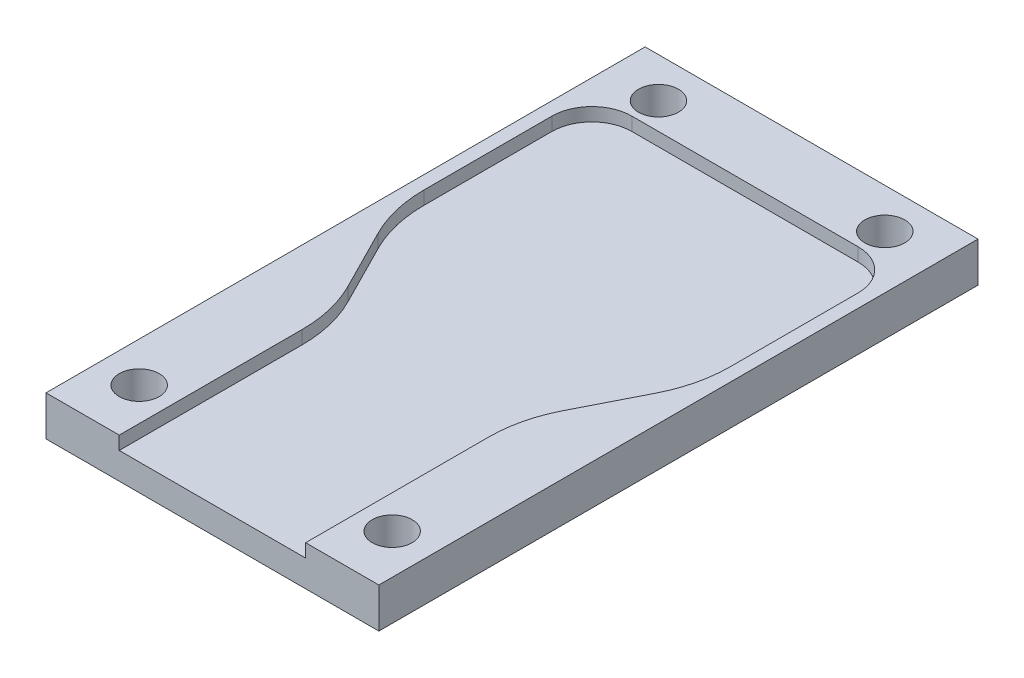
ISO-10303-21;
HEADER;
FILE_DESCRIPTION(('STEP AP214'),'2;1');
FILE_NAME('part.step','',(''),(''),'','','');
FILE_SCHEMA(('AUTOMOTIVE_DESIGN { 1 0 10303 214 1 1 1 1 }'));
ENDSEC;
DATA;
#1=APPLICATION_CONTEXT('core data for automotive mechanical design processes');
#2=APPLICATION_PROTOCOL_DEFINITION('international standard','automotive_design',2000,#1);
#3=PRODUCT_CONTEXT('',#1,'mechanical');
#4=PRODUCT('Part','Part','',(#3));
#5=PRODUCT_RELATED_PRODUCT_CATEGORY('part','',(#4));
#6=PRODUCT_DEFINITION_FORMATION('','',#4);
#7=PRODUCT_DEFINITION_CONTEXT('part definition',#1,'design');
#8=PRODUCT_DEFINITION('design','',#6,#7);
#9=PRODUCT_DEFINITION_SHAPE('','',#8);
#10=(LENGTH_UNIT() NAMED_UNIT(*) SI_UNIT(.MILLI.,.METRE.));
#11=(NAMED_UNIT(*) PLANE_ANGLE_UNIT() SI_UNIT($,.RADIAN.));
#12=(NAMED_UNIT(*) SI_UNIT($,.STERADIAN.) SOLID_ANGLE_UNIT());
#13=UNCERTAINTY_MEASURE_WITH_UNIT(LENGTH_MEASURE(1.E-05),#10,'distance_accuracy_value','');
#14=(GEOMETRIC_REPRESENTATION_CONTEXT(3) GLOBAL_UNCERTAINTY_ASSIGNED_CONTEXT((#13)) GLOBAL_UNIT_ASSIGNED_CONTEXT((#10,
#11,#12)) REPRESENTATION_CONTEXT('',''));
#15=CARTESIAN_POINT('',(0.,0.,0.));
#16=DIRECTION('',(0.,0.,1.));
#17=DIRECTION('',(1.,0.,0.));
#18=AXIS2_PLACEMENT_3D('',#15,#16,#17);
#19=CARTESIAN_POINT('',(0.,3.,0.));
#20=DIRECTION('',(0.,0.,-1.));
#21=DIRECTION('',(-1.,0.,0.));
#22=AXIS2_PLACEMENT_3D('',#19,#20,#21);
#23=PLANE('',#22);
#24=DIRECTION('',(0.,1.,0.));
#25=VECTOR('',#24,1.);
#26=CARTESIAN_POINT('',(19.5,2.,0.));
#27=LINE('',#26,#25);
#28=CARTESIAN_POINT('',(19.5,2.,0.));
#29=VERTEX_POINT('',#28);
#30=CARTESIAN_POINT('',(19.5,3.,0.));
#31=VERTEX_POINT('',#30);
#32=EDGE_CURVE('E307',#29,#31,#27,.T.);
#33=ORIENTED_EDGE('',*,*,#32,.F.);
#34=DIRECTION('',(1.,0.,0.));
#35=VECTOR('',#34,1.);
#36=CARTESIAN_POINT('',(5.5,2.,0.));
#37=LINE('',#36,#35);
#38=CARTESIAN_POINT('',(5.5,2.,0.));
#39=VERTEX_POINT('',#38);
#40=EDGE_CURVE('E229',#39,#29,#37,.T.);
#41=ORIENTED_EDGE('',*,*,#40,.F.);
#42=DIRECTION('',(0.,1.,0.));
#43=VECTOR('',#42,1.);
#44=CARTESIAN_POINT('',(5.5,2.,0.));
#45=LINE('',#44,#43);
#46=CARTESIAN_POINT('',(5.5,3.,0.));
#47=VERTEX_POINT('',#46);
#48=EDGE_CURVE('E310',#39,#47,#45,.T.);
#49=ORIENTED_EDGE('',*,*,#48,.T.);
#50=DIRECTION('',(1.,0.,0.));
#51=VECTOR('',#50,1.);
#52=CARTESIAN_POINT('',(0.,3.,0.));
#53=LINE('',#52,#51);
#54=CARTESIAN_POINT('',(0.,3.,0.));
#55=VERTEX_POINT('',#54);
#56=EDGE_CURVE('E92',#55,#47,#53,.T.);
#57=ORIENTED_EDGE('',*,*,#56,.F.);
#58=DIRECTION('',(0.,-1.,0.));
#59=VECTOR('',#58,1.);
#60=CARTESIAN_POINT('',(0.,3.,0.));
#61=LINE('',#60,#59);
#62=CARTESIAN_POINT('',(0.,0.,0.));
#63=VERTEX_POINT('',#62);
#64=EDGE_CURVE('E11',#55,#63,#61,.T.);
#65=ORIENTED_EDGE('',*,*,#64,.T.);
#66=DIRECTION('',(1.,0.,0.));
#67=VECTOR('',#66,1.);
#68=CARTESIAN_POINT('',(0.,0.,0.));
#69=LINE('',#68,#67);
#70=CARTESIAN_POINT('',(25.,0.,0.));
#71=VERTEX_POINT('',#70);
#72=EDGE_CURVE('E345',#63,#71,#69,.T.);
#73=ORIENTED_EDGE('',*,*,#72,.T.);
#74=DIRECTION('',(0.,-1.,0.));
#75=VECTOR('',#74,1.);
#76=CARTESIAN_POINT('',(25.,3.,0.));
#77=LINE('',#76,#75);
#78=CARTESIAN_POINT('',(25.,3.,0.));
#79=VERTEX_POINT('',#78);
#80=EDGE_CURVE('E48',#79,#71,#77,.T.);
#81=ORIENTED_EDGE('',*,*,#80,.F.);
#82=EDGE_CURVE('E333',#31,#79,#53,.T.);
#83=ORIENTED_EDGE('',*,*,#82,.F.);
#84=EDGE_LOOP('',(#33,#41,#49,#57,#65,#73,#81,#83));
#85=FACE_BOUND('',#84,.T.);
#86=ADVANCED_FACE('F39',(#85),#23,.F.);
#87=CARTESIAN_POINT('',(0.,3.,0.));
#88=DIRECTION('',(0.,-1.,0.));
#89=DIRECTION('',(0.,0.,-1.));
#90=AXIS2_PLACEMENT_3D('',#87,#88,#89);
#91=PLANE('',#90);
#92=CARTESIAN_POINT('',(22.,3.,-4.));
#93=DIRECTION('',(0.,1.,0.));
#94=DIRECTION('',(0.,0.,1.));
#95=AXIS2_PLACEMENT_3D('',#92,#93,#94);
#96=CIRCLE('',#95,1.5);
#97=CARTESIAN_POINT('',(22.,3.,-2.5));
#98=VERTEX_POINT('',#97);
#99=EDGE_CURVE('E514',#98,#98,#96,.T.);
#100=ORIENTED_EDGE('',*,*,#99,.F.);
#101=EDGE_LOOP('',(#100));
#102=FACE_BOUND('',#101,.T.);
#103=CARTESIAN_POINT('',(3.,3.,-4.));
#104=DIRECTION('',(0.,1.,0.));
#105=DIRECTION('',(0.,0.,1.));
#106=AXIS2_PLACEMENT_3D('',#103,#104,#105);
#107=CIRCLE('',#106,1.5);
#108=CARTESIAN_POINT('',(3.,3.,-2.5));
#109=VERTEX_POINT('',#108);
#110=EDGE_CURVE('E504',#109,#109,#107,.T.);
#111=ORIENTED_EDGE('',*,*,#110,.F.);
#112=EDGE_LOOP('',(#111));
#113=FACE_BOUND('',#112,.T.);
#114=CARTESIAN_POINT('',(4.,3.,-42.));
#115=DIRECTION('',(0.,1.,0.));
#116=DIRECTION('',(0.,0.,1.));
#117=AXIS2_PLACEMENT_3D('',#114,#115,#116);
#118=CIRCLE('',#117,1.5);
#119=CARTESIAN_POINT('',(4.,3.,-40.5));
#120=VERTEX_POINT('',#119);
#121=EDGE_CURVE('E495',#120,#120,#118,.T.);
#122=ORIENTED_EDGE('',*,*,#121,.F.);
#123=EDGE_LOOP('',(#122));
#124=FACE_BOUND('',#123,.T.);
#125=CARTESIAN_POINT('',(21.,3.,-42.));
#126=DIRECTION('',(0.,1.,0.));
#127=DIRECTION('',(0.,0.,1.));
#128=AXIS2_PLACEMENT_3D('',#125,#126,#127);
#129=CIRCLE('',#128,1.5);
#130=CARTESIAN_POINT('',(21.,3.,-40.5));
#131=VERTEX_POINT('',#130);
#132=EDGE_CURVE('E205',#131,#131,#129,.T.);
#133=ORIENTED_EDGE('',*,*,#132,.F.);
#134=EDGE_LOOP('',(#133));
#135=FACE_BOUND('',#134,.T.);
#136=DIRECTION('',(0.,0.,1.));
#137=VECTOR('',#136,1.);
#138=CARTESIAN_POINT('',(19.5,3.,-13.7348257942628));
#139=LINE('',#138,#137);
#140=CARTESIAN_POINT('',(19.5,3.,-13.7348257942629));
#141=VERTEX_POINT('',#140);
#142=EDGE_CURVE('E276',#141,#31,#139,.T.);
#143=ORIENTED_EDGE('',*,*,#142,.T.);
#144=ORIENTED_EDGE('',*,*,#82,.T.);
#145=DIRECTION('',(0.,0.,-1.));
#146=VECTOR('',#145,1.);
#147=CARTESIAN_POINT('',(25.,3.,0.));
#148=LINE('',#147,#146);
#149=CARTESIAN_POINT('',(25.,3.,-45.));
#150=VERTEX_POINT('',#149);
#151=EDGE_CURVE('E336',#79,#150,#148,.T.);
#152=ORIENTED_EDGE('',*,*,#151,.T.);
#153=DIRECTION('',(-1.,0.,0.));
#154=VECTOR('',#153,1.);
#155=CARTESIAN_POINT('',(0.,3.,-45.));
#156=LINE('',#155,#154);
#157=CARTESIAN_POINT('',(0.,3.,-45.));
#158=VERTEX_POINT('',#157);
#159=EDGE_CURVE('E64',#150,#158,#156,.T.);
#160=ORIENTED_EDGE('',*,*,#159,.T.);
#161=DIRECTION('',(0.,0.,1.));
#162=VECTOR('',#161,1.);
#163=CARTESIAN_POINT('',(0.,3.,0.));
#164=LINE('',#163,#162);
#165=EDGE_CURVE('E330',#158,#55,#164,.T.);
#166=ORIENTED_EDGE('',*,*,#165,.T.);
#167=ORIENTED_EDGE('',*,*,#56,.T.);
#168=DIRECTION('',(0.,0.,1.));
#169=VECTOR('',#168,1.);
#170=CARTESIAN_POINT('',(5.5,3.,-13.7348257942629));
#171=LINE('',#170,#169);
#172=CARTESIAN_POINT('',(5.5,3.,-13.7348257942629));
#173=VERTEX_POINT('',#172);
#174=EDGE_CURVE('E273',#173,#47,#171,.T.);
#175=ORIENTED_EDGE('',*,*,#174,.F.);
#176=CARTESIAN_POINT('',(-4.5,3.,-13.7348257942629));
#177=DIRECTION('',(0.,-1.,0.));
#178=DIRECTION('',(0.,0.,-1.));
#179=AXIS2_PLACEMENT_3D('',#176,#177,#178);
#180=CIRCLE('',#179,10.);
#181=CARTESIAN_POINT('',(4.41895802874741,3.,-18.2572352937932));
#182=VERTEX_POINT('',#181);
#183=EDGE_CURVE('E269',#182,#173,#180,.T.);
#184=ORIENTED_EDGE('',*,*,#183,.F.);
#185=DIRECTION('',(0.452240949953029,0.,0.891895802874743));
#186=VECTOR('',#185,1.);
#187=CARTESIAN_POINT('',(2.08104197125259,3.,-22.868002008682));
#188=LINE('',#187,#186);
#189=CARTESIAN_POINT('',(2.08104197125259,3.,-22.868002008682));
#190=VERTEX_POINT('',#189);
#191=EDGE_CURVE('E265',#190,#182,#188,.T.);
#192=ORIENTED_EDGE('',*,*,#191,.F.);
#193=CARTESIAN_POINT('',(11.,3.,-27.3904115082123));
#194=DIRECTION('',(0.,-1.,0.));
#195=DIRECTION('',(0.,0.,-1.));
#196=AXIS2_PLACEMENT_3D('',#193,#194,#195);
#197=CIRCLE('',#196,10.);
#198=CARTESIAN_POINT('',(1.,3.,-27.3904115082123));
#199=VERTEX_POINT('',#198);
#200=EDGE_CURVE('E261',#190,#199,#197,.T.);
#201=ORIENTED_EDGE('',*,*,#200,.T.);
#202=DIRECTION('',(0.,0.,1.));
#203=VECTOR('',#202,1.);
#204=CARTESIAN_POINT('',(0.999999999999999,3.,-37.));
#205=LINE('',#204,#203);
#206=CARTESIAN_POINT('',(0.999999999999999,3.,-37.));
#207=VERTEX_POINT('',#206);
#208=EDGE_CURVE('E257',#207,#199,#205,.T.);
#209=ORIENTED_EDGE('',*,*,#208,.F.);
#210=CARTESIAN_POINT('',(4.,3.,-37.));
#211=DIRECTION('',(0.,1.,0.));
#212=DIRECTION('',(0.,0.,1.));
#213=AXIS2_PLACEMENT_3D('',#210,#211,#212);
#214=CIRCLE('',#213,3.);
#215=CARTESIAN_POINT('',(4.00000000000002,3.,-40.));
#216=VERTEX_POINT('',#215);
#217=EDGE_CURVE('E253',#216,#207,#214,.T.);
#218=ORIENTED_EDGE('',*,*,#217,.F.);
#219=DIRECTION('',(1.,0.,0.));
#220=VECTOR('',#219,1.);
#221=CARTESIAN_POINT('',(4.00000000000002,3.,-40.));
#222=LINE('',#221,#220);
#223=CARTESIAN_POINT('',(21.,3.,-40.));
#224=VERTEX_POINT('',#223);
#225=EDGE_CURVE('E249',#216,#224,#222,.T.);
#226=ORIENTED_EDGE('',*,*,#225,.T.);
#227=CARTESIAN_POINT('',(21.,3.,-37.));
#228=DIRECTION('',(0.,1.,0.));
#229=DIRECTION('',(0.,0.,1.));
#230=AXIS2_PLACEMENT_3D('',#227,#228,#229);
#231=CIRCLE('',#230,3.);
#232=CARTESIAN_POINT('',(24.,3.,-37.));
#233=VERTEX_POINT('',#232);
#234=EDGE_CURVE('E55',#233,#224,#231,.T.);
#235=ORIENTED_EDGE('',*,*,#234,.F.);
#236=DIRECTION('',(0.,0.,1.));
#237=VECTOR('',#236,1.);
#238=CARTESIAN_POINT('',(24.,3.,-37.));
#239=LINE('',#238,#237);
#240=CARTESIAN_POINT('',(24.,3.,-27.3904115082123));
#241=VERTEX_POINT('',#240);
#242=EDGE_CURVE('E198',#233,#241,#239,.T.);
#243=ORIENTED_EDGE('',*,*,#242,.T.);
#244=CARTESIAN_POINT('',(14.,3.,-27.3904115082123));
#245=DIRECTION('',(0.,1.,0.));
#246=DIRECTION('',(0.,0.,1.));
#247=AXIS2_PLACEMENT_3D('',#244,#245,#246);
#248=CIRCLE('',#247,10.);
#249=CARTESIAN_POINT('',(22.9189580287474,3.,-22.8680020086819));
#250=VERTEX_POINT('',#249);
#251=EDGE_CURVE('E202',#250,#241,#248,.T.);
#252=ORIENTED_EDGE('',*,*,#251,.F.);
#253=DIRECTION('',(-0.45224094995303,0.,0.891895802874742));
#254=VECTOR('',#253,1.);
#255=CARTESIAN_POINT('',(22.9189580287474,3.,-22.8680020086819));
#256=LINE('',#255,#254);
#257=CARTESIAN_POINT('',(20.5810419712526,3.,-18.2572352937932));
#258=VERTEX_POINT('',#257);
#259=EDGE_CURVE('E284',#250,#258,#256,.T.);
#260=ORIENTED_EDGE('',*,*,#259,.T.);
#261=CARTESIAN_POINT('',(29.5,3.,-13.7348257942629));
#262=DIRECTION('',(0.,1.,0.));
#263=DIRECTION('',(0.,0.,1.));
#264=AXIS2_PLACEMENT_3D('',#261,#262,#263);
#265=CIRCLE('',#264,10.);
#266=EDGE_CURVE('E280',#258,#141,#265,.T.);
#267=ORIENTED_EDGE('',*,*,#266,.T.);
#268=EDGE_LOOP('',(#143,#144,#152,#160,#166,#167,#175,#184,#192,#201,#209,#218,#226,#235,#243,
#252,#260,#267));
#269=FACE_BOUND('',#268,.T.);
#270=ADVANCED_FACE('F383',(#102,#113,#124,#135,#269),#91,.F.);
#271=CARTESIAN_POINT('',(0.,3.,0.));
#272=DIRECTION('',(1.,0.,0.));
#273=DIRECTION('',(0.,0.,-1.));
#274=AXIS2_PLACEMENT_3D('',#271,#272,#273);
#275=PLANE('',#274);
#276=DIRECTION('',(0.,0.,1.));
#277=VECTOR('',#276,1.);
#278=CARTESIAN_POINT('',(0.,0.,0.));
#279=LINE('',#278,#277);
#280=CARTESIAN_POINT('',(0.,0.,-45.));
#281=VERTEX_POINT('',#280);
#282=EDGE_CURVE('E294',#281,#63,#279,.T.);
#283=ORIENTED_EDGE('',*,*,#282,.T.);
#284=ORIENTED_EDGE('',*,*,#64,.F.);
#285=ORIENTED_EDGE('',*,*,#165,.F.);
#286=DIRECTION('',(0.,-1.,0.));
#287=VECTOR('',#286,1.);
#288=CARTESIAN_POINT('',(0.,3.,-45.));
#289=LINE('',#288,#287);
#290=EDGE_CURVE('E341',#158,#281,#289,.T.);
#291=ORIENTED_EDGE('',*,*,#290,.T.);
#292=EDGE_LOOP('',(#283,#284,#285,#291));
#293=FACE_BOUND('',#292,.T.);
#294=ADVANCED_FACE('F41',(#293),#275,.F.);
#295=CARTESIAN_POINT('',(25.,3.,0.));
#296=DIRECTION('',(-1.,0.,0.));
#297=DIRECTION('',(0.,0.,1.));
#298=AXIS2_PLACEMENT_3D('',#295,#296,#297);
#299=PLANE('',#298);
#300=DIRECTION('',(0.,0.,-1.));
#301=VECTOR('',#300,1.);
#302=CARTESIAN_POINT('',(25.,0.,0.));
#303=LINE('',#302,#301);
#304=CARTESIAN_POINT('',(25.,0.,-45.));
#305=VERTEX_POINT('',#304);
#306=EDGE_CURVE('E348',#71,#305,#303,.T.);
#307=ORIENTED_EDGE('',*,*,#306,.T.);
#308=DIRECTION('',(0.,-1.,0.));
#309=VECTOR('',#308,1.);
#310=CARTESIAN_POINT('',(25.,3.,-45.));
#311=LINE('',#310,#309);
#312=EDGE_CURVE('E355',#150,#305,#311,.T.);
#313=ORIENTED_EDGE('',*,*,#312,.F.);
#314=ORIENTED_EDGE('',*,*,#151,.F.);
#315=ORIENTED_EDGE('',*,*,#80,.T.);
#316=EDGE_LOOP('',(#307,#313,#314,#315));
#317=FACE_BOUND('',#316,.T.);
#318=ADVANCED_FACE('F363',(#317),#299,.F.);
#319=CARTESIAN_POINT('',(0.,3.,-45.));
#320=DIRECTION('',(0.,0.,1.));
#321=DIRECTION('',(1.,0.,0.));
#322=AXIS2_PLACEMENT_3D('',#319,#320,#321);
#323=PLANE('',#322);
#324=DIRECTION('',(-1.,0.,0.));
#325=VECTOR('',#324,1.);
#326=CARTESIAN_POINT('',(0.,0.,-45.));
#327=LINE('',#326,#325);
#328=EDGE_CURVE('E85',#305,#281,#327,.T.);
#329=ORIENTED_EDGE('',*,*,#328,.T.);
#330=ORIENTED_EDGE('',*,*,#290,.F.);
#331=ORIENTED_EDGE('',*,*,#159,.F.);
#332=ORIENTED_EDGE('',*,*,#312,.T.);
#333=EDGE_LOOP('',(#329,#330,#331,#332));
#334=FACE_BOUND('',#333,.T.);
#335=ADVANCED_FACE('F372',(#334),#323,.F.);
#336=CARTESIAN_POINT('',(0.,0.,0.));
#337=DIRECTION('',(0.,-1.,0.));
#338=DIRECTION('',(0.,0.,-1.));
#339=AXIS2_PLACEMENT_3D('',#336,#337,#338);
#340=PLANE('',#339);
#341=CARTESIAN_POINT('',(22.,0.,-4.));
#342=DIRECTION('',(0.,1.,0.));
#343=DIRECTION('',(0.,0.,1.));
#344=AXIS2_PLACEMENT_3D('',#341,#342,#343);
#345=CIRCLE('',#344,1.5);
#346=CARTESIAN_POINT('',(22.,0.,-2.5));
#347=VERTEX_POINT('',#346);
#348=EDGE_CURVE('E510',#347,#347,#345,.T.);
#349=ORIENTED_EDGE('',*,*,#348,.T.);
#350=EDGE_LOOP('',(#349));
#351=FACE_BOUND('',#350,.T.);
#352=CARTESIAN_POINT('',(3.,0.,-4.));
#353=DIRECTION('',(0.,1.,0.));
#354=DIRECTION('',(0.,0.,1.));
#355=AXIS2_PLACEMENT_3D('',#352,#353,#354);
#356=CIRCLE('',#355,1.5);
#357=CARTESIAN_POINT('',(3.,0.,-2.5));
#358=VERTEX_POINT('',#357);
#359=EDGE_CURVE('E498',#358,#358,#356,.T.);
#360=ORIENTED_EDGE('',*,*,#359,.T.);
#361=EDGE_LOOP('',(#360));
#362=FACE_BOUND('',#361,.T.);
#363=CARTESIAN_POINT('',(4.,0.,-42.));
#364=DIRECTION('',(0.,1.,0.));
#365=DIRECTION('',(0.,0.,1.));
#366=AXIS2_PLACEMENT_3D('',#363,#364,#365);
#367=CIRCLE('',#366,1.5);
#368=CARTESIAN_POINT('',(4.,0.,-40.5));
#369=VERTEX_POINT('',#368);
#370=EDGE_CURVE('E492',#369,#369,#367,.T.);
#371=ORIENTED_EDGE('',*,*,#370,.T.);
#372=EDGE_LOOP('',(#371));
#373=FACE_BOUND('',#372,.T.);
#374=CARTESIAN_POINT('',(21.,0.,-42.));
#375=DIRECTION('',(0.,1.,0.));
#376=DIRECTION('',(0.,0.,1.));
#377=AXIS2_PLACEMENT_3D('',#374,#375,#376);
#378=CIRCLE('',#377,1.5);
#379=CARTESIAN_POINT('',(21.,0.,-40.5));
#380=VERTEX_POINT('',#379);
#381=EDGE_CURVE('E250',#380,#380,#378,.T.);
#382=ORIENTED_EDGE('',*,*,#381,.T.);
#383=EDGE_LOOP('',(#382));
#384=FACE_BOUND('',#383,.T.);
#385=ORIENTED_EDGE('',*,*,#282,.F.);
#386=ORIENTED_EDGE('',*,*,#328,.F.);
#387=ORIENTED_EDGE('',*,*,#306,.F.);
#388=ORIENTED_EDGE('',*,*,#72,.F.);
#389=EDGE_LOOP('',(#385,#386,#387,#388));
#390=FACE_BOUND('',#389,.T.);
#391=ADVANCED_FACE('F368',(#351,#362,#373,#384,#390),#340,.T.);
#392=CARTESIAN_POINT('',(21.,2.,-37.));
#393=DIRECTION('',(0.,1.,0.));
#394=DIRECTION('',(0.,0.,1.));
#395=AXIS2_PLACEMENT_3D('',#392,#393,#394);
#396=CYLINDRICAL_SURFACE('',#395,3.);
#397=ORIENTED_EDGE('',*,*,#234,.T.);
#398=DIRECTION('',(0.,1.,0.));
#399=VECTOR('',#398,1.);
#400=CARTESIAN_POINT('',(21.,2.,-40.));
#401=LINE('',#400,#399);
#402=CARTESIAN_POINT('',(21.,2.,-40.));
#403=VERTEX_POINT('',#402);
#404=EDGE_CURVE('E178',#403,#224,#401,.T.);
#405=ORIENTED_EDGE('',*,*,#404,.F.);
#406=CARTESIAN_POINT('',(21.,2.,-37.));
#407=DIRECTION('',(0.,1.,0.));
#408=DIRECTION('',(0.,0.,1.));
#409=AXIS2_PLACEMENT_3D('',#406,#407,#408);
#410=CIRCLE('',#409,3.);
#411=CARTESIAN_POINT('',(24.,2.,-37.));
#412=VERTEX_POINT('',#411);
#413=EDGE_CURVE('E187',#412,#403,#410,.T.);
#414=ORIENTED_EDGE('',*,*,#413,.F.);
#415=DIRECTION('',(0.,1.,0.));
#416=VECTOR('',#415,1.);
#417=CARTESIAN_POINT('',(24.,2.,-37.));
#418=LINE('',#417,#416);
#419=EDGE_CURVE('E291',#412,#233,#418,.T.);
#420=ORIENTED_EDGE('',*,*,#419,.T.);
#421=EDGE_LOOP('',(#397,#405,#414,#420));
#422=FACE_BOUND('',#421,.T.);
#423=ADVANCED_FACE('F190',(#422),#396,.F.);
#424=CARTESIAN_POINT('',(24.,2.,-37.));
#425=DIRECTION('',(-1.,0.,0.));
#426=DIRECTION('',(0.,0.,1.));
#427=AXIS2_PLACEMENT_3D('',#424,#425,#426);
#428=PLANE('',#427);
#429=ORIENTED_EDGE('',*,*,#242,.F.);
#430=ORIENTED_EDGE('',*,*,#419,.F.);
#431=DIRECTION('',(0.,0.,1.));
#432=VECTOR('',#431,1.);
#433=CARTESIAN_POINT('',(24.,2.,-37.));
#434=LINE('',#433,#432);
#435=CARTESIAN_POINT('',(24.,2.,-27.3904115082123));
#436=VERTEX_POINT('',#435);
#437=EDGE_CURVE('E192',#412,#436,#434,.T.);
#438=ORIENTED_EDGE('',*,*,#437,.T.);
#439=DIRECTION('',(0.,1.,0.));
#440=VECTOR('',#439,1.);
#441=CARTESIAN_POINT('',(24.,2.,-27.3904115082123));
#442=LINE('',#441,#440);
#443=EDGE_CURVE('E295',#436,#241,#442,.T.);
#444=ORIENTED_EDGE('',*,*,#443,.T.);
#445=EDGE_LOOP('',(#429,#430,#438,#444));
#446=FACE_BOUND('',#445,.T.);
#447=ADVANCED_FACE('F430',(#446),#428,.T.);
#448=CARTESIAN_POINT('',(14.,2.,-27.3904115082123));
#449=DIRECTION('',(0.,1.,0.));
#450=DIRECTION('',(0.,0.,1.));
#451=AXIS2_PLACEMENT_3D('',#448,#449,#450);
#452=CYLINDRICAL_SURFACE('',#451,10.);
#453=ORIENTED_EDGE('',*,*,#251,.T.);
#454=ORIENTED_EDGE('',*,*,#443,.F.);
#455=CARTESIAN_POINT('',(14.,2.,-27.3904115082123));
#456=DIRECTION('',(0.,1.,0.));
#457=DIRECTION('',(0.,0.,1.));
#458=AXIS2_PLACEMENT_3D('',#455,#456,#457);
#459=CIRCLE('',#458,10.);
#460=CARTESIAN_POINT('',(22.9189580287474,2.,-22.8680020086819));
#461=VERTEX_POINT('',#460);
#462=EDGE_CURVE('E242',#461,#436,#459,.T.);
#463=ORIENTED_EDGE('',*,*,#462,.F.);
#464=DIRECTION('',(0.,1.,0.));
#465=VECTOR('',#464,1.);
#466=CARTESIAN_POINT('',(22.9189580287474,2.,-22.8680020086819));
#467=LINE('',#466,#465);
#468=EDGE_CURVE('E298',#461,#250,#467,.T.);
#469=ORIENTED_EDGE('',*,*,#468,.T.);
#470=EDGE_LOOP('',(#453,#454,#463,#469));
#471=FACE_BOUND('',#470,.T.);
#472=ADVANCED_FACE('F434',(#471),#452,.F.);
#473=CARTESIAN_POINT('',(22.9189580287474,2.,-22.8680020086819));
#474=DIRECTION('',(-0.891895802874742,0.,-0.45224094995303));
#475=DIRECTION('',(-0.45224094995303,0.,0.891895802874742));
#476=AXIS2_PLACEMENT_3D('',#473,#474,#475);
#477=PLANE('',#476);
#478=ORIENTED_EDGE('',*,*,#259,.F.);
#479=ORIENTED_EDGE('',*,*,#468,.F.);
#480=DIRECTION('',(-0.45224094995303,0.,0.891895802874742));
#481=VECTOR('',#480,1.);
#482=CARTESIAN_POINT('',(22.9189580287474,2.,-22.8680020086819));
#483=LINE('',#482,#481);
#484=CARTESIAN_POINT('',(20.5810419712526,2.,-18.2572352937932));
#485=VERTEX_POINT('',#484);
#486=EDGE_CURVE('E239',#461,#485,#483,.T.);
#487=ORIENTED_EDGE('',*,*,#486,.T.);
#488=DIRECTION('',(0.,1.,0.));
#489=VECTOR('',#488,1.);
#490=CARTESIAN_POINT('',(20.5810419712526,2.,-18.2572352937932));
#491=LINE('',#490,#489);
#492=EDGE_CURVE('E301',#485,#258,#491,.T.);
#493=ORIENTED_EDGE('',*,*,#492,.T.);
#494=EDGE_LOOP('',(#478,#479,#487,#493));
#495=FACE_BOUND('',#494,.T.);
#496=ADVANCED_FACE('F436',(#495),#477,.T.);
#497=CARTESIAN_POINT('',(29.5,2.,-13.7348257942629));
#498=DIRECTION('',(0.,1.,0.));
#499=DIRECTION('',(0.,0.,1.));
#500=AXIS2_PLACEMENT_3D('',#497,#498,#499);
#501=CYLINDRICAL_SURFACE('',#500,10.);
#502=ORIENTED_EDGE('',*,*,#266,.F.);
#503=ORIENTED_EDGE('',*,*,#492,.F.);
#504=CARTESIAN_POINT('',(29.5,2.,-13.7348257942629));
#505=DIRECTION('',(0.,1.,0.));
#506=DIRECTION('',(0.,0.,1.));
#507=AXIS2_PLACEMENT_3D('',#504,#505,#506);
#508=CIRCLE('',#507,10.);
#509=CARTESIAN_POINT('',(19.5,2.,-13.7348257942629));
#510=VERTEX_POINT('',#509);
#511=EDGE_CURVE('E236',#485,#510,#508,.T.);
#512=ORIENTED_EDGE('',*,*,#511,.T.);
#513=DIRECTION('',(0.,1.,0.));
#514=VECTOR('',#513,1.);
#515=CARTESIAN_POINT('',(19.5,2.,-13.7348257942629));
#516=LINE('',#515,#514);
#517=EDGE_CURVE('E304',#510,#141,#516,.T.);
#518=ORIENTED_EDGE('',*,*,#517,.T.);
#519=EDGE_LOOP('',(#502,#503,#512,#518));
#520=FACE_BOUND('',#519,.T.);
#521=ADVANCED_FACE('F401',(#520),#501,.T.);
#522=CARTESIAN_POINT('',(19.5,2.,-13.7348257942628));
#523=DIRECTION('',(-1.,0.,0.));
#524=DIRECTION('',(0.,0.,1.));
#525=AXIS2_PLACEMENT_3D('',#522,#523,#524);
#526=PLANE('',#525);
#527=ORIENTED_EDGE('',*,*,#142,.F.);
#528=ORIENTED_EDGE('',*,*,#517,.F.);
#529=DIRECTION('',(0.,0.,1.));
#530=VECTOR('',#529,1.);
#531=CARTESIAN_POINT('',(19.5,2.,-13.7348257942628));
#532=LINE('',#531,#530);
#533=EDGE_CURVE('E233',#510,#29,#532,.T.);
#534=ORIENTED_EDGE('',*,*,#533,.T.);
#535=ORIENTED_EDGE('',*,*,#32,.T.);
#536=EDGE_LOOP('',(#527,#528,#534,#535));
#537=FACE_BOUND('',#536,.T.);
#538=ADVANCED_FACE('F393',(#537),#526,.T.);
#539=CARTESIAN_POINT('',(5.5,2.,-13.7348257942629));
#540=DIRECTION('',(-1.,0.,0.));
#541=DIRECTION('',(0.,0.,1.));
#542=AXIS2_PLACEMENT_3D('',#539,#540,#541);
#543=PLANE('',#542);
#544=ORIENTED_EDGE('',*,*,#174,.T.);
#545=ORIENTED_EDGE('',*,*,#48,.F.);
#546=DIRECTION('',(0.,0.,1.));
#547=VECTOR('',#546,1.);
#548=CARTESIAN_POINT('',(5.5,2.,-13.7348257942629));
#549=LINE('',#548,#547);
#550=CARTESIAN_POINT('',(5.5,2.,-13.7348257942629));
#551=VERTEX_POINT('',#550);
#552=EDGE_CURVE('E225',#551,#39,#549,.T.);
#553=ORIENTED_EDGE('',*,*,#552,.F.);
#554=DIRECTION('',(0.,1.,0.));
#555=VECTOR('',#554,1.);
#556=CARTESIAN_POINT('',(5.5,2.,-13.7348257942629));
#557=LINE('',#556,#555);
#558=EDGE_CURVE('E313',#551,#173,#557,.T.);
#559=ORIENTED_EDGE('',*,*,#558,.T.);
#560=EDGE_LOOP('',(#544,#545,#553,#559));
#561=FACE_BOUND('',#560,.T.);
#562=ADVANCED_FACE('F407',(#561),#543,.F.);
#563=CARTESIAN_POINT('',(-4.5,2.,-13.7348257942629));
#564=DIRECTION('',(0.,1.,0.));
#565=DIRECTION('',(0.,0.,1.));
#566=AXIS2_PLACEMENT_3D('',#563,#564,#565);
#567=CYLINDRICAL_SURFACE('',#566,10.);
#568=ORIENTED_EDGE('',*,*,#183,.T.);
#569=ORIENTED_EDGE('',*,*,#558,.F.);
#570=CARTESIAN_POINT('',(-4.5,2.,-13.7348257942629));
#571=DIRECTION('',(0.,-1.,0.));
#572=DIRECTION('',(0.,0.,-1.));
#573=AXIS2_PLACEMENT_3D('',#570,#571,#572);
#574=CIRCLE('',#573,10.);
#575=CARTESIAN_POINT('',(4.41895802874741,2.,-18.2572352937932));
#576=VERTEX_POINT('',#575);
#577=EDGE_CURVE('E221',#576,#551,#574,.T.);
#578=ORIENTED_EDGE('',*,*,#577,.F.);
#579=DIRECTION('',(0.,1.,0.));
#580=VECTOR('',#579,1.);
#581=CARTESIAN_POINT('',(4.41895802874741,2.,-18.2572352937932));
#582=LINE('',#581,#580);
#583=EDGE_CURVE('E316',#576,#182,#582,.T.);
#584=ORIENTED_EDGE('',*,*,#583,.T.);
#585=EDGE_LOOP('',(#568,#569,#578,#584));
#586=FACE_BOUND('',#585,.T.);
#587=ADVANCED_FACE('F412',(#586),#567,.T.);
#588=CARTESIAN_POINT('',(2.08104197125259,2.,-22.868002008682));
#589=DIRECTION('',(-0.891895802874743,0.,0.452240949953029));
#590=DIRECTION('',(0.452240949953029,0.,0.891895802874743));
#591=AXIS2_PLACEMENT_3D('',#588,#589,#590);
#592=PLANE('',#591);
#593=ORIENTED_EDGE('',*,*,#191,.T.);
#594=ORIENTED_EDGE('',*,*,#583,.F.);
#595=DIRECTION('',(0.452240949953029,0.,0.891895802874743));
#596=VECTOR('',#595,1.);
#597=CARTESIAN_POINT('',(2.08104197125259,2.,-22.868002008682));
#598=LINE('',#597,#596);
#599=CARTESIAN_POINT('',(2.08104197125259,2.,-22.868002008682));
#600=VERTEX_POINT('',#599);
#601=EDGE_CURVE('E217',#600,#576,#598,.T.);
#602=ORIENTED_EDGE('',*,*,#601,.F.);
#603=DIRECTION('',(0.,1.,0.));
#604=VECTOR('',#603,1.);
#605=CARTESIAN_POINT('',(2.08104197125259,2.,-22.868002008682));
#606=LINE('',#605,#604);
#607=EDGE_CURVE('E319',#600,#190,#606,.T.);
#608=ORIENTED_EDGE('',*,*,#607,.T.);
#609=EDGE_LOOP('',(#593,#594,#602,#608));
#610=FACE_BOUND('',#609,.T.);
#611=ADVANCED_FACE('F415',(#610),#592,.F.);
#612=CARTESIAN_POINT('',(11.,2.,-27.3904115082123));
#613=DIRECTION('',(0.,1.,0.));
#614=DIRECTION('',(0.,0.,1.));
#615=AXIS2_PLACEMENT_3D('',#612,#613,#614);
#616=CYLINDRICAL_SURFACE('',#615,10.);
#617=ORIENTED_EDGE('',*,*,#200,.F.);
#618=ORIENTED_EDGE('',*,*,#607,.F.);
#619=CARTESIAN_POINT('',(11.,2.,-27.3904115082123));
#620=DIRECTION('',(0.,-1.,0.));
#621=DIRECTION('',(0.,0.,-1.));
#622=AXIS2_PLACEMENT_3D('',#619,#620,#621);
#623=CIRCLE('',#622,10.);
#624=CARTESIAN_POINT('',(1.,2.,-27.3904115082123));
#625=VERTEX_POINT('',#624);
#626=EDGE_CURVE('E214',#600,#625,#623,.T.);
#627=ORIENTED_EDGE('',*,*,#626,.T.);
#628=DIRECTION('',(0.,1.,0.));
#629=VECTOR('',#628,1.);
#630=CARTESIAN_POINT('',(1.,2.,-27.3904115082123));
#631=LINE('',#630,#629);
#632=EDGE_CURVE('E322',#625,#199,#631,.T.);
#633=ORIENTED_EDGE('',*,*,#632,.T.);
#634=EDGE_LOOP('',(#617,#618,#627,#633));
#635=FACE_BOUND('',#634,.T.);
#636=ADVANCED_FACE('F419',(#635),#616,.F.);
#637=CARTESIAN_POINT('',(0.999999999999999,2.,-37.));
#638=DIRECTION('',(-1.,0.,0.));
#639=DIRECTION('',(0.,0.,1.));
#640=AXIS2_PLACEMENT_3D('',#637,#638,#639);
#641=PLANE('',#640);
#642=ORIENTED_EDGE('',*,*,#208,.T.);
#643=ORIENTED_EDGE('',*,*,#632,.F.);
#644=DIRECTION('',(0.,0.,1.));
#645=VECTOR('',#644,1.);
#646=CARTESIAN_POINT('',(0.999999999999999,2.,-37.));
#647=LINE('',#646,#645);
#648=CARTESIAN_POINT('',(0.999999999999999,2.,-37.));
#649=VERTEX_POINT('',#648);
#650=EDGE_CURVE('E210',#649,#625,#647,.T.);
#651=ORIENTED_EDGE('',*,*,#650,.F.);
#652=DIRECTION('',(0.,1.,0.));
#653=VECTOR('',#652,1.);
#654=CARTESIAN_POINT('',(0.999999999999999,2.,-37.));
#655=LINE('',#654,#653);
#656=EDGE_CURVE('E325',#649,#207,#655,.T.);
#657=ORIENTED_EDGE('',*,*,#656,.T.);
#658=EDGE_LOOP('',(#642,#643,#651,#657));
#659=FACE_BOUND('',#658,.T.);
#660=ADVANCED_FACE('F424',(#659),#641,.F.);
#661=CARTESIAN_POINT('',(4.,2.,-37.));
#662=DIRECTION('',(0.,1.,0.));
#663=DIRECTION('',(0.,0.,1.));
#664=AXIS2_PLACEMENT_3D('',#661,#662,#663);
#665=CYLINDRICAL_SURFACE('',#664,3.);
#666=ORIENTED_EDGE('',*,*,#217,.T.);
#667=ORIENTED_EDGE('',*,*,#656,.F.);
#668=CARTESIAN_POINT('',(4.,2.,-37.));
#669=DIRECTION('',(0.,1.,0.));
#670=DIRECTION('',(0.,0.,1.));
#671=AXIS2_PLACEMENT_3D('',#668,#669,#670);
#672=CIRCLE('',#671,3.);
#673=CARTESIAN_POINT('',(4.00000000000002,2.,-40.));
#674=VERTEX_POINT('',#673);
#675=EDGE_CURVE('E186',#674,#649,#672,.T.);
#676=ORIENTED_EDGE('',*,*,#675,.F.);
#677=DIRECTION('',(0.,1.,0.));
#678=VECTOR('',#677,1.);
#679=CARTESIAN_POINT('',(4.00000000000002,2.,-40.));
#680=LINE('',#679,#678);
#681=EDGE_CURVE('E180',#674,#216,#680,.T.);
#682=ORIENTED_EDGE('',*,*,#681,.T.);
#683=EDGE_LOOP('',(#666,#667,#676,#682));
#684=FACE_BOUND('',#683,.T.);
#685=ADVANCED_FACE('F427',(#684),#665,.F.);
#686=CARTESIAN_POINT('',(4.00000000000002,2.,-40.));
#687=DIRECTION('',(0.,0.,1.));
#688=DIRECTION('',(1.,0.,0.));
#689=AXIS2_PLACEMENT_3D('',#686,#687,#688);
#690=PLANE('',#689);
#691=ORIENTED_EDGE('',*,*,#225,.F.);
#692=ORIENTED_EDGE('',*,*,#681,.F.);
#693=DIRECTION('',(1.,0.,0.));
#694=VECTOR('',#693,1.);
#695=CARTESIAN_POINT('',(4.00000000000002,2.,-40.));
#696=LINE('',#695,#694);
#697=EDGE_CURVE('E175',#674,#403,#696,.T.);
#698=ORIENTED_EDGE('',*,*,#697,.T.);
#699=ORIENTED_EDGE('',*,*,#404,.T.);
#700=EDGE_LOOP('',(#691,#692,#698,#699));
#701=FACE_BOUND('',#700,.T.);
#702=ADVANCED_FACE('F177',(#701),#690,.T.);
#703=CARTESIAN_POINT('',(21.,2.,-37.));
#704=DIRECTION('',(0.,1.,0.));
#705=DIRECTION('',(0.,0.,1.));
#706=AXIS2_PLACEMENT_3D('',#703,#704,#705);
#707=PLANE('',#706);
#708=ORIENTED_EDGE('',*,*,#413,.T.);
#709=ORIENTED_EDGE('',*,*,#697,.F.);
#710=ORIENTED_EDGE('',*,*,#675,.T.);
#711=ORIENTED_EDGE('',*,*,#650,.T.);
#712=ORIENTED_EDGE('',*,*,#626,.F.);
#713=ORIENTED_EDGE('',*,*,#601,.T.);
#714=ORIENTED_EDGE('',*,*,#577,.T.);
#715=ORIENTED_EDGE('',*,*,#552,.T.);
#716=ORIENTED_EDGE('',*,*,#40,.T.);
#717=ORIENTED_EDGE('',*,*,#533,.F.);
#718=ORIENTED_EDGE('',*,*,#511,.F.);
#719=ORIENTED_EDGE('',*,*,#486,.F.);
#720=ORIENTED_EDGE('',*,*,#462,.T.);
#721=ORIENTED_EDGE('',*,*,#437,.F.);
#722=EDGE_LOOP('',(#708,#709,#710,#711,#712,#713,#714,#715,#716,#717,#718,#719,#720,#721));
#723=FACE_BOUND('',#722,.T.);
#724=ADVANCED_FACE('F195',(#723),#707,.T.);
#725=CARTESIAN_POINT('',(21.,0.,-42.));
#726=DIRECTION('',(0.,1.,0.));
#727=DIRECTION('',(0.,0.,1.));
#728=AXIS2_PLACEMENT_3D('',#725,#726,#727);
#729=CYLINDRICAL_SURFACE('',#728,1.5);
#730=ORIENTED_EDGE('',*,*,#381,.F.);
#731=EDGE_LOOP('',(#730));
#732=FACE_BOUND('',#731,.T.);
#733=ORIENTED_EDGE('',*,*,#132,.T.);
#734=EDGE_LOOP('',(#733));
#735=FACE_BOUND('',#734,.T.);
#736=ADVANCED_FACE('F472',(#732,#735),#729,.F.);
#737=CARTESIAN_POINT('',(4.,0.,-42.));
#738=DIRECTION('',(0.,1.,0.));
#739=DIRECTION('',(0.,0.,1.));
#740=AXIS2_PLACEMENT_3D('',#737,#738,#739);
#741=CYLINDRICAL_SURFACE('',#740,1.5);
#742=ORIENTED_EDGE('',*,*,#370,.F.);
#743=EDGE_LOOP('',(#742));
#744=FACE_BOUND('',#743,.T.);
#745=ORIENTED_EDGE('',*,*,#121,.T.);
#746=EDGE_LOOP('',(#745));
#747=FACE_BOUND('',#746,.T.);
#748=ADVANCED_FACE('F475',(#744,#747),#741,.F.);
#749=CARTESIAN_POINT('',(3.,0.,-4.));
#750=DIRECTION('',(0.,1.,0.));
#751=DIRECTION('',(0.,0.,1.));
#752=AXIS2_PLACEMENT_3D('',#749,#750,#751);
#753=CYLINDRICAL_SURFACE('',#752,1.5);
#754=ORIENTED_EDGE('',*,*,#359,.F.);
#755=EDGE_LOOP('',(#754));
#756=FACE_BOUND('',#755,.T.);
#757=ORIENTED_EDGE('',*,*,#110,.T.);
#758=EDGE_LOOP('',(#757));
#759=FACE_BOUND('',#758,.T.);
#760=ADVANCED_FACE('F480',(#756,#759),#753,.F.);
#761=CARTESIAN_POINT('',(22.,0.,-4.));
#762=DIRECTION('',(0.,1.,0.));
#763=DIRECTION('',(0.,0.,1.));
#764=AXIS2_PLACEMENT_3D('',#761,#762,#763);
#765=CYLINDRICAL_SURFACE('',#764,1.5);
#766=ORIENTED_EDGE('',*,*,#348,.F.);
#767=EDGE_LOOP('',(#766));
#768=FACE_BOUND('',#767,.T.);
#769=ORIENTED_EDGE('',*,*,#99,.T.);
#770=EDGE_LOOP('',(#769));
#771=FACE_BOUND('',#770,.T.);
#772=ADVANCED_FACE('F477',(#768,#771),#765,.F.);
#773=CLOSED_SHELL('',(#86,#270,#294,#318,#335,#391,#423,#447,#472,#496,#521,#538,#562,#587,#611,
#636,#660,#685,#702,#724,#736,#748,#760,#772));
#774=MANIFOLD_SOLID_BREP('B2',#773);
#775=ADVANCED_BREP_SHAPE_REPRESENTATION('',(#18,#774),#14);
#776=SHAPE_DEFINITION_REPRESENTATION(#9,#775);
ENDSEC;
END-ISO-10303-21;
